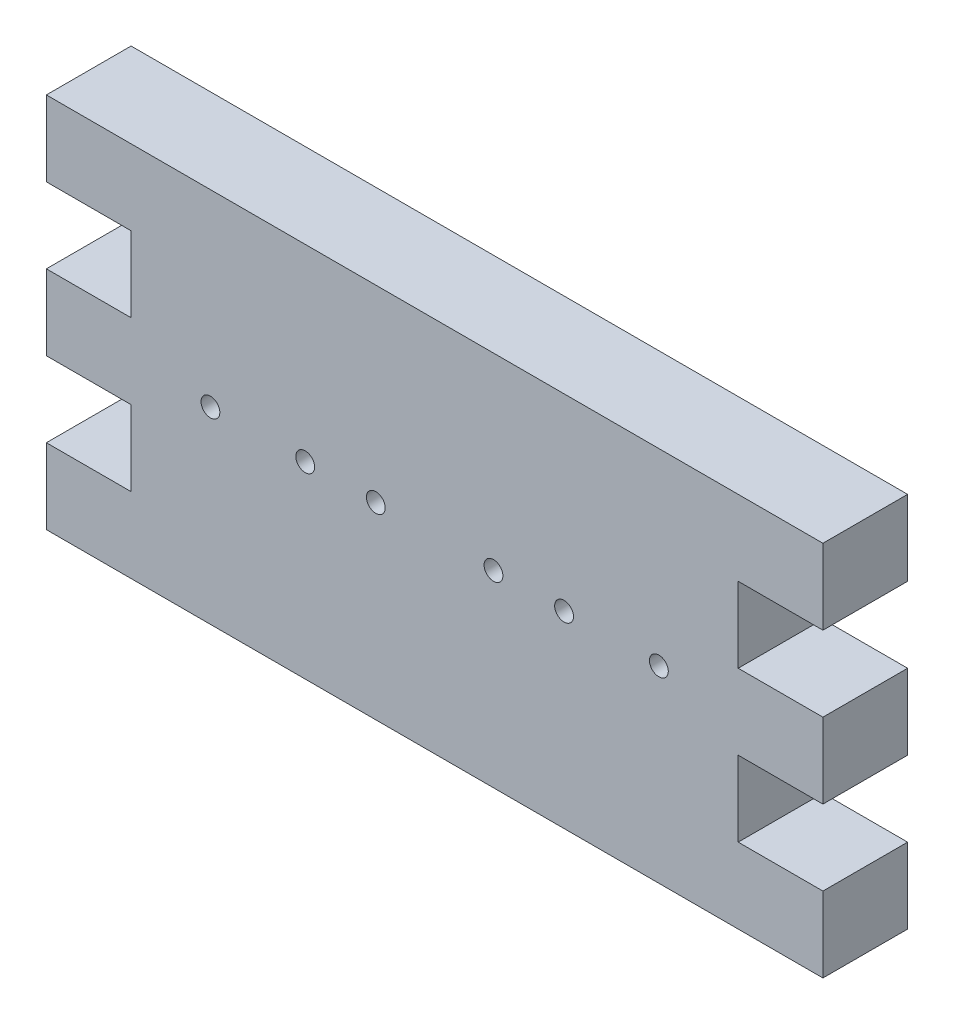
ISO-10303-21;
HEADER;
FILE_DESCRIPTION(('STEP AP214'),'2;1');
FILE_NAME('part.step','',(''),(''),'','','');
FILE_SCHEMA(('AUTOMOTIVE_DESIGN { 1 0 10303 214 1 1 1 1 }'));
ENDSEC;
DATA;
#1=APPLICATION_CONTEXT('core data for automotive mechanical design processes');
#2=APPLICATION_PROTOCOL_DEFINITION('international standard','automotive_design',2000,#1);
#3=PRODUCT_CONTEXT('',#1,'mechanical');
#4=PRODUCT('Part','Part','',(#3));
#5=PRODUCT_RELATED_PRODUCT_CATEGORY('part','',(#4));
#6=PRODUCT_DEFINITION_FORMATION('','',#4);
#7=PRODUCT_DEFINITION_CONTEXT('part definition',#1,'design');
#8=PRODUCT_DEFINITION('design','',#6,#7);
#9=PRODUCT_DEFINITION_SHAPE('','',#8);
#10=(LENGTH_UNIT() NAMED_UNIT(*) SI_UNIT(.MILLI.,.METRE.));
#11=(NAMED_UNIT(*) PLANE_ANGLE_UNIT() SI_UNIT($,.RADIAN.));
#12=(NAMED_UNIT(*) SI_UNIT($,.STERADIAN.) SOLID_ANGLE_UNIT());
#13=UNCERTAINTY_MEASURE_WITH_UNIT(LENGTH_MEASURE(1.E-05),#10,'distance_accuracy_value','');
#14=(GEOMETRIC_REPRESENTATION_CONTEXT(3) GLOBAL_UNCERTAINTY_ASSIGNED_CONTEXT((#13)) GLOBAL_UNIT_ASSIGNED_CONTEXT((#10,
#11,#12)) REPRESENTATION_CONTEXT('',''));
#15=CARTESIAN_POINT('',(0.,0.,0.));
#16=DIRECTION('',(0.,0.,1.));
#17=DIRECTION('',(1.,0.,0.));
#18=AXIS2_PLACEMENT_3D('',#15,#16,#17);
#19=CARTESIAN_POINT('',(0.,0.,18.));
#20=DIRECTION('',(0.,0.,-1.));
#21=DIRECTION('',(-1.,0.,0.));
#22=AXIS2_PLACEMENT_3D('',#19,#20,#21);
#23=PLANE('',#22);
#24=DIRECTION('',(0.,1.,0.));
#25=VECTOR('',#24,1.);
#26=CARTESIAN_POINT('',(122.500000000001,14.0000000000007,18.));
#27=LINE('',#26,#25);
#28=CARTESIAN_POINT('',(122.500000000001,14.0000000000007,18.));
#29=VERTEX_POINT('',#28);
#30=CARTESIAN_POINT('',(122.5,30.,18.));
#31=VERTEX_POINT('',#30);
#32=EDGE_CURVE('E241',#29,#31,#27,.T.);
#33=ORIENTED_EDGE('',*,*,#32,.T.);
#34=DIRECTION('',(-1.,0.,0.));
#35=VECTOR('',#34,1.);
#36=CARTESIAN_POINT('',(-42.5,30.,18.));
#37=LINE('',#36,#35);
#38=CARTESIAN_POINT('',(-42.5,30.,18.));
#39=VERTEX_POINT('',#38);
#40=EDGE_CURVE('E129',#31,#39,#37,.T.);
#41=ORIENTED_EDGE('',*,*,#40,.T.);
#42=DIRECTION('',(0.,-1.,0.));
#43=VECTOR('',#42,1.);
#44=CARTESIAN_POINT('',(-42.5,14.,18.));
#45=LINE('',#44,#43);
#46=CARTESIAN_POINT('',(-42.5,14.,18.));
#47=VERTEX_POINT('',#46);
#48=EDGE_CURVE('E292',#39,#47,#45,.T.);
#49=ORIENTED_EDGE('',*,*,#48,.T.);
#50=DIRECTION('',(1.,0.,0.));
#51=VECTOR('',#50,1.);
#52=CARTESIAN_POINT('',(-42.5,14.,18.));
#53=LINE('',#52,#51);
#54=CARTESIAN_POINT('',(-24.5,14.,18.));
#55=VERTEX_POINT('',#54);
#56=EDGE_CURVE('E311',#47,#55,#53,.T.);
#57=ORIENTED_EDGE('',*,*,#56,.T.);
#58=DIRECTION('',(0.,-1.,0.));
#59=VECTOR('',#58,1.);
#60=CARTESIAN_POINT('',(-24.5,-1.99999999999998,18.));
#61=LINE('',#60,#59);
#62=CARTESIAN_POINT('',(-24.5,-1.99999999999998,18.));
#63=VERTEX_POINT('',#62);
#64=EDGE_CURVE('E308',#55,#63,#61,.T.);
#65=ORIENTED_EDGE('',*,*,#64,.T.);
#66=DIRECTION('',(-1.,0.,0.));
#67=VECTOR('',#66,1.);
#68=CARTESIAN_POINT('',(-42.5,-2.00000000000002,18.));
#69=LINE('',#68,#67);
#70=CARTESIAN_POINT('',(-42.5,-2.00000000000002,18.));
#71=VERTEX_POINT('',#70);
#72=EDGE_CURVE('E310',#63,#71,#69,.T.);
#73=ORIENTED_EDGE('',*,*,#72,.T.);
#74=DIRECTION('',(0.,-1.,0.));
#75=VECTOR('',#74,1.);
#76=CARTESIAN_POINT('',(-42.5,-18.,18.));
#77=LINE('',#76,#75);
#78=CARTESIAN_POINT('',(-42.5,-18.,18.));
#79=VERTEX_POINT('',#78);
#80=EDGE_CURVE('E313',#71,#79,#77,.T.);
#81=ORIENTED_EDGE('',*,*,#80,.T.);
#82=DIRECTION('',(1.,0.,0.));
#83=VECTOR('',#82,1.);
#84=CARTESIAN_POINT('',(-42.5,-18.,18.));
#85=LINE('',#84,#83);
#86=CARTESIAN_POINT('',(-24.5,-18.,18.));
#87=VERTEX_POINT('',#86);
#88=EDGE_CURVE('E319',#79,#87,#85,.T.);
#89=ORIENTED_EDGE('',*,*,#88,.T.);
#90=DIRECTION('',(0.,-1.,0.));
#91=VECTOR('',#90,1.);
#92=CARTESIAN_POINT('',(-24.5,-34.,18.));
#93=LINE('',#92,#91);
#94=CARTESIAN_POINT('',(-24.5,-34.,18.));
#95=VERTEX_POINT('',#94);
#96=EDGE_CURVE('E321',#87,#95,#93,.T.);
#97=ORIENTED_EDGE('',*,*,#96,.T.);
#98=DIRECTION('',(-1.,0.,0.));
#99=VECTOR('',#98,1.);
#100=CARTESIAN_POINT('',(-42.5,-34.,18.));
#101=LINE('',#100,#99);
#102=CARTESIAN_POINT('',(-42.5,-34.,18.));
#103=VERTEX_POINT('',#102);
#104=EDGE_CURVE('E323',#95,#103,#101,.T.);
#105=ORIENTED_EDGE('',*,*,#104,.T.);
#106=DIRECTION('',(0.,-1.,0.));
#107=VECTOR('',#106,1.);
#108=CARTESIAN_POINT('',(-42.5,-50.,18.));
#109=LINE('',#108,#107);
#110=CARTESIAN_POINT('',(-42.5,-50.,18.));
#111=VERTEX_POINT('',#110);
#112=EDGE_CURVE('E325',#103,#111,#109,.T.);
#113=ORIENTED_EDGE('',*,*,#112,.T.);
#114=DIRECTION('',(1.,0.,0.));
#115=VECTOR('',#114,1.);
#116=CARTESIAN_POINT('',(-42.5,-50.,18.));
#117=LINE('',#116,#115);
#118=CARTESIAN_POINT('',(122.5,-50.,18.));
#119=VERTEX_POINT('',#118);
#120=EDGE_CURVE('E327',#111,#119,#117,.T.);
#121=ORIENTED_EDGE('',*,*,#120,.T.);
#122=DIRECTION('',(0.,1.,0.));
#123=VECTOR('',#122,1.);
#124=CARTESIAN_POINT('',(122.5,-50.,18.));
#125=LINE('',#124,#123);
#126=CARTESIAN_POINT('',(122.500000000002,-33.9999999999994,18.));
#127=VERTEX_POINT('',#126);
#128=EDGE_CURVE('E329',#119,#127,#125,.T.);
#129=ORIENTED_EDGE('',*,*,#128,.T.);
#130=DIRECTION('',(-1.,0.,0.));
#131=VECTOR('',#130,1.);
#132=CARTESIAN_POINT('',(122.500000000002,-33.9999999999994,18.));
#133=LINE('',#132,#131);
#134=CARTESIAN_POINT('',(104.500000000002,-33.9999999999996,18.));
#135=VERTEX_POINT('',#134);
#136=EDGE_CURVE('E331',#127,#135,#133,.T.);
#137=ORIENTED_EDGE('',*,*,#136,.T.);
#138=DIRECTION('',(0.,1.,0.));
#139=VECTOR('',#138,1.);
#140=CARTESIAN_POINT('',(104.500000000002,-33.9999999999996,18.));
#141=LINE('',#140,#139);
#142=CARTESIAN_POINT('',(104.500000000002,-17.9999999999996,18.));
#143=VERTEX_POINT('',#142);
#144=EDGE_CURVE('E333',#135,#143,#141,.T.);
#145=ORIENTED_EDGE('',*,*,#144,.T.);
#146=DIRECTION('',(1.,0.,0.));
#147=VECTOR('',#146,1.);
#148=CARTESIAN_POINT('',(122.500000000002,-17.9999999999993,18.));
#149=LINE('',#148,#147);
#150=CARTESIAN_POINT('',(122.500000000002,-17.9999999999993,18.));
#151=VERTEX_POINT('',#150);
#152=EDGE_CURVE('E335',#143,#151,#149,.T.);
#153=ORIENTED_EDGE('',*,*,#152,.T.);
#154=DIRECTION('',(0.,1.,0.));
#155=VECTOR('',#154,1.);
#156=CARTESIAN_POINT('',(122.500000000002,-17.9999999999993,18.));
#157=LINE('',#156,#155);
#158=CARTESIAN_POINT('',(122.500000000001,-1.99999999999935,18.));
#159=VERTEX_POINT('',#158);
#160=EDGE_CURVE('E184',#151,#159,#157,.T.);
#161=ORIENTED_EDGE('',*,*,#160,.T.);
#162=DIRECTION('',(-1.,0.,0.));
#163=VECTOR('',#162,1.);
#164=CARTESIAN_POINT('',(122.500000000001,-1.99999999999935,18.));
#165=LINE('',#164,#163);
#166=CARTESIAN_POINT('',(104.500000000001,-1.99999999999954,18.));
#167=VERTEX_POINT('',#166);
#168=EDGE_CURVE('E178',#159,#167,#165,.T.);
#169=ORIENTED_EDGE('',*,*,#168,.T.);
#170=DIRECTION('',(0.,1.,0.));
#171=VECTOR('',#170,1.);
#172=CARTESIAN_POINT('',(104.500000000001,-1.99999999999954,18.));
#173=LINE('',#172,#171);
#174=CARTESIAN_POINT('',(104.500000000001,14.0000000000005,18.));
#175=VERTEX_POINT('',#174);
#176=EDGE_CURVE('E182',#167,#175,#173,.T.);
#177=ORIENTED_EDGE('',*,*,#176,.T.);
#178=DIRECTION('',(1.,0.,0.));
#179=VECTOR('',#178,1.);
#180=CARTESIAN_POINT('',(122.500000000001,14.0000000000007,18.));
#181=LINE('',#180,#179);
#182=EDGE_CURVE('E50',#175,#29,#181,.T.);
#183=ORIENTED_EDGE('',*,*,#182,.T.);
#184=EDGE_LOOP('',(#33,#41,#49,#57,#65,#73,#81,#89,#97,#105,#113,#121,#129,#137,#145,#153,#161,
#169,#177,#183));
#185=FACE_BOUND('',#184,.T.);
#186=CARTESIAN_POINT('',(12.5,-10.,18.));
#187=DIRECTION('',(0.,0.,1.));
#188=DIRECTION('',(1.,0.,0.));
#189=AXIS2_PLACEMENT_3D('',#186,#187,#188);
#190=CIRCLE('',#189,2.);
#191=CARTESIAN_POINT('',(14.5,-10.,18.));
#192=VERTEX_POINT('',#191);
#193=EDGE_CURVE('E206',#192,#192,#190,.T.);
#194=ORIENTED_EDGE('',*,*,#193,.F.);
#195=EDGE_LOOP('',(#194));
#196=FACE_BOUND('',#195,.T.);
#197=CARTESIAN_POINT('',(-7.64571959777527,-10.,18.));
#198=DIRECTION('',(0.,0.,1.));
#199=DIRECTION('',(1.,0.,0.));
#200=AXIS2_PLACEMENT_3D('',#197,#198,#199);
#201=CIRCLE('',#200,2.);
#202=CARTESIAN_POINT('',(-5.64571959777527,-10.,18.));
#203=VERTEX_POINT('',#202);
#204=EDGE_CURVE('E419',#203,#203,#201,.T.);
#205=ORIENTED_EDGE('',*,*,#204,.F.);
#206=EDGE_LOOP('',(#205));
#207=FACE_BOUND('',#206,.T.);
#208=CARTESIAN_POINT('',(27.5000000000001,-9.99999999999992,18.));
#209=DIRECTION('',(0.,0.,1.));
#210=DIRECTION('',(1.,0.,0.));
#211=AXIS2_PLACEMENT_3D('',#208,#209,#210);
#212=CIRCLE('',#211,2.);
#213=CARTESIAN_POINT('',(29.5000000000001,-9.99999999999992,18.));
#214=VERTEX_POINT('',#213);
#215=EDGE_CURVE('E413',#214,#214,#212,.T.);
#216=ORIENTED_EDGE('',*,*,#215,.F.);
#217=EDGE_LOOP('',(#216));
#218=FACE_BOUND('',#217,.T.);
#219=CARTESIAN_POINT('',(52.5000000000014,-9.99999999999992,18.));
#220=DIRECTION('',(0.,0.,1.));
#221=DIRECTION('',(-1.,0.,0.));
#222=AXIS2_PLACEMENT_3D('',#219,#220,#221);
#223=CIRCLE('',#222,2.00000000000001);
#224=CARTESIAN_POINT('',(50.5000000000014,-9.99999999999992,18.));
#225=VERTEX_POINT('',#224);
#226=EDGE_CURVE('E407',#225,#225,#223,.T.);
#227=ORIENTED_EDGE('',*,*,#226,.F.);
#228=EDGE_LOOP('',(#227));
#229=FACE_BOUND('',#228,.T.);
#230=CARTESIAN_POINT('',(67.5000000000015,-9.99999999999978,18.));
#231=DIRECTION('',(0.,0.,1.));
#232=DIRECTION('',(-1.,0.,0.));
#233=AXIS2_PLACEMENT_3D('',#230,#231,#232);
#234=CIRCLE('',#233,2.00000000000001);
#235=CARTESIAN_POINT('',(65.5000000000015,-9.99999999999978,18.));
#236=VERTEX_POINT('',#235);
#237=EDGE_CURVE('E401',#236,#236,#234,.T.);
#238=ORIENTED_EDGE('',*,*,#237,.F.);
#239=EDGE_LOOP('',(#238));
#240=FACE_BOUND('',#239,.T.);
#241=CARTESIAN_POINT('',(87.6457195977753,-10.,18.));
#242=DIRECTION('',(0.,0.,1.));
#243=DIRECTION('',(-1.,0.,0.));
#244=AXIS2_PLACEMENT_3D('',#241,#242,#243);
#245=CIRCLE('',#244,2.00000000000001);
#246=CARTESIAN_POINT('',(85.6457195977753,-10.,18.));
#247=VERTEX_POINT('',#246);
#248=EDGE_CURVE('E392',#247,#247,#245,.T.);
#249=ORIENTED_EDGE('',*,*,#248,.F.);
#250=EDGE_LOOP('',(#249));
#251=FACE_BOUND('',#250,.T.);
#252=ADVANCED_FACE('F33',(#185,#196,#207,#218,#229,#240,#251),#23,.F.);
#253=CARTESIAN_POINT('',(0.,0.,0.));
#254=DIRECTION('',(0.,0.,-1.));
#255=DIRECTION('',(-1.,0.,0.));
#256=AXIS2_PLACEMENT_3D('',#253,#254,#255);
#257=PLANE('',#256);
#258=CARTESIAN_POINT('',(67.5000000000015,-9.99999999999978,0.));
#259=DIRECTION('',(0.,0.,1.));
#260=DIRECTION('',(-1.,0.,0.));
#261=AXIS2_PLACEMENT_3D('',#258,#259,#260);
#262=CIRCLE('',#261,2.00000000000001);
#263=CARTESIAN_POINT('',(65.5000000000015,-9.99999999999978,0.));
#264=VERTEX_POINT('',#263);
#265=EDGE_CURVE('E398',#264,#264,#262,.T.);
#266=ORIENTED_EDGE('',*,*,#265,.T.);
#267=EDGE_LOOP('',(#266));
#268=FACE_BOUND('',#267,.T.);
#269=CARTESIAN_POINT('',(27.5000000000001,-9.99999999999992,0.));
#270=DIRECTION('',(0.,0.,1.));
#271=DIRECTION('',(1.,0.,0.));
#272=AXIS2_PLACEMENT_3D('',#269,#270,#271);
#273=CIRCLE('',#272,2.);
#274=CARTESIAN_POINT('',(29.5000000000001,-9.99999999999992,0.));
#275=VERTEX_POINT('',#274);
#276=EDGE_CURVE('E410',#275,#275,#273,.T.);
#277=ORIENTED_EDGE('',*,*,#276,.T.);
#278=EDGE_LOOP('',(#277));
#279=FACE_BOUND('',#278,.T.);
#280=CARTESIAN_POINT('',(12.5,-10.,0.));
#281=DIRECTION('',(0.,0.,1.));
#282=DIRECTION('',(1.,0.,0.));
#283=AXIS2_PLACEMENT_3D('',#280,#281,#282);
#284=CIRCLE('',#283,2.);
#285=CARTESIAN_POINT('',(14.5,-10.,0.));
#286=VERTEX_POINT('',#285);
#287=EDGE_CURVE('E422',#286,#286,#284,.T.);
#288=ORIENTED_EDGE('',*,*,#287,.T.);
#289=EDGE_LOOP('',(#288));
#290=FACE_BOUND('',#289,.T.);
#291=DIRECTION('',(0.,1.,0.));
#292=VECTOR('',#291,1.);
#293=CARTESIAN_POINT('',(122.500000000001,14.0000000000007,0.));
#294=LINE('',#293,#292);
#295=CARTESIAN_POINT('',(122.500000000001,14.0000000000007,0.));
#296=VERTEX_POINT('',#295);
#297=CARTESIAN_POINT('',(122.5,30.,0.));
#298=VERTEX_POINT('',#297);
#299=EDGE_CURVE('E202',#296,#298,#294,.T.);
#300=ORIENTED_EDGE('',*,*,#299,.F.);
#301=DIRECTION('',(1.,0.,0.));
#302=VECTOR('',#301,1.);
#303=CARTESIAN_POINT('',(122.500000000001,14.0000000000007,0.));
#304=LINE('',#303,#302);
#305=CARTESIAN_POINT('',(104.500000000001,14.0000000000005,0.));
#306=VERTEX_POINT('',#305);
#307=EDGE_CURVE('E121',#306,#296,#304,.T.);
#308=ORIENTED_EDGE('',*,*,#307,.F.);
#309=DIRECTION('',(0.,1.,0.));
#310=VECTOR('',#309,1.);
#311=CARTESIAN_POINT('',(104.500000000001,-1.99999999999954,0.));
#312=LINE('',#311,#310);
#313=CARTESIAN_POINT('',(104.500000000001,-1.99999999999954,0.));
#314=VERTEX_POINT('',#313);
#315=EDGE_CURVE('E115',#314,#306,#312,.T.);
#316=ORIENTED_EDGE('',*,*,#315,.F.);
#317=DIRECTION('',(-1.,0.,0.));
#318=VECTOR('',#317,1.);
#319=CARTESIAN_POINT('',(122.500000000001,-1.99999999999935,0.));
#320=LINE('',#319,#318);
#321=CARTESIAN_POINT('',(122.500000000001,-1.99999999999935,0.));
#322=VERTEX_POINT('',#321);
#323=EDGE_CURVE('E192',#322,#314,#320,.T.);
#324=ORIENTED_EDGE('',*,*,#323,.F.);
#325=DIRECTION('',(0.,1.,0.));
#326=VECTOR('',#325,1.);
#327=CARTESIAN_POINT('',(122.500000000002,-17.9999999999993,0.));
#328=LINE('',#327,#326);
#329=CARTESIAN_POINT('',(122.500000000002,-17.9999999999993,0.));
#330=VERTEX_POINT('',#329);
#331=EDGE_CURVE('E236',#330,#322,#328,.T.);
#332=ORIENTED_EDGE('',*,*,#331,.F.);
#333=DIRECTION('',(1.,0.,0.));
#334=VECTOR('',#333,1.);
#335=CARTESIAN_POINT('',(122.500000000002,-17.9999999999993,0.));
#336=LINE('',#335,#334);
#337=CARTESIAN_POINT('',(104.500000000002,-17.9999999999996,0.));
#338=VERTEX_POINT('',#337);
#339=EDGE_CURVE('E234',#338,#330,#336,.T.);
#340=ORIENTED_EDGE('',*,*,#339,.F.);
#341=DIRECTION('',(0.,1.,0.));
#342=VECTOR('',#341,1.);
#343=CARTESIAN_POINT('',(104.500000000002,-33.9999999999996,0.));
#344=LINE('',#343,#342);
#345=CARTESIAN_POINT('',(104.500000000002,-33.9999999999996,0.));
#346=VERTEX_POINT('',#345);
#347=EDGE_CURVE('E232',#346,#338,#344,.T.);
#348=ORIENTED_EDGE('',*,*,#347,.F.);
#349=DIRECTION('',(-1.,0.,0.));
#350=VECTOR('',#349,1.);
#351=CARTESIAN_POINT('',(122.500000000002,-33.9999999999994,0.));
#352=LINE('',#351,#350);
#353=CARTESIAN_POINT('',(122.500000000002,-33.9999999999994,0.));
#354=VERTEX_POINT('',#353);
#355=EDGE_CURVE('E230',#354,#346,#352,.T.);
#356=ORIENTED_EDGE('',*,*,#355,.F.);
#357=DIRECTION('',(0.,1.,0.));
#358=VECTOR('',#357,1.);
#359=CARTESIAN_POINT('',(122.5,-50.,0.));
#360=LINE('',#359,#358);
#361=CARTESIAN_POINT('',(122.5,-50.,0.));
#362=VERTEX_POINT('',#361);
#363=EDGE_CURVE('E228',#362,#354,#360,.T.);
#364=ORIENTED_EDGE('',*,*,#363,.F.);
#365=DIRECTION('',(1.,0.,0.));
#366=VECTOR('',#365,1.);
#367=CARTESIAN_POINT('',(-42.5,-50.,0.));
#368=LINE('',#367,#366);
#369=CARTESIAN_POINT('',(-42.5,-50.,0.));
#370=VERTEX_POINT('',#369);
#371=EDGE_CURVE('E226',#370,#362,#368,.T.);
#372=ORIENTED_EDGE('',*,*,#371,.F.);
#373=DIRECTION('',(0.,-1.,0.));
#374=VECTOR('',#373,1.);
#375=CARTESIAN_POINT('',(-42.5,-50.,0.));
#376=LINE('',#375,#374);
#377=CARTESIAN_POINT('',(-42.5,-34.,0.));
#378=VERTEX_POINT('',#377);
#379=EDGE_CURVE('E224',#378,#370,#376,.T.);
#380=ORIENTED_EDGE('',*,*,#379,.F.);
#381=DIRECTION('',(-1.,0.,0.));
#382=VECTOR('',#381,1.);
#383=CARTESIAN_POINT('',(-42.5,-34.,0.));
#384=LINE('',#383,#382);
#385=CARTESIAN_POINT('',(-24.5,-34.,0.));
#386=VERTEX_POINT('',#385);
#387=EDGE_CURVE('E222',#386,#378,#384,.T.);
#388=ORIENTED_EDGE('',*,*,#387,.F.);
#389=DIRECTION('',(0.,-1.,0.));
#390=VECTOR('',#389,1.);
#391=CARTESIAN_POINT('',(-24.5,-34.,0.));
#392=LINE('',#391,#390);
#393=CARTESIAN_POINT('',(-24.5,-18.,0.));
#394=VERTEX_POINT('',#393);
#395=EDGE_CURVE('E220',#394,#386,#392,.T.);
#396=ORIENTED_EDGE('',*,*,#395,.F.);
#397=DIRECTION('',(1.,0.,0.));
#398=VECTOR('',#397,1.);
#399=CARTESIAN_POINT('',(-42.5,-18.,0.));
#400=LINE('',#399,#398);
#401=CARTESIAN_POINT('',(-42.5,-18.,0.));
#402=VERTEX_POINT('',#401);
#403=EDGE_CURVE('E218',#402,#394,#400,.T.);
#404=ORIENTED_EDGE('',*,*,#403,.F.);
#405=DIRECTION('',(0.,-1.,0.));
#406=VECTOR('',#405,1.);
#407=CARTESIAN_POINT('',(-42.5,-18.,0.));
#408=LINE('',#407,#406);
#409=CARTESIAN_POINT('',(-42.5,-2.00000000000002,0.));
#410=VERTEX_POINT('',#409);
#411=EDGE_CURVE('E216',#410,#402,#408,.T.);
#412=ORIENTED_EDGE('',*,*,#411,.F.);
#413=DIRECTION('',(-1.,0.,0.));
#414=VECTOR('',#413,1.);
#415=CARTESIAN_POINT('',(-42.5,-2.00000000000002,0.));
#416=LINE('',#415,#414);
#417=CARTESIAN_POINT('',(-24.5,-1.99999999999998,0.));
#418=VERTEX_POINT('',#417);
#419=EDGE_CURVE('E214',#418,#410,#416,.T.);
#420=ORIENTED_EDGE('',*,*,#419,.F.);
#421=DIRECTION('',(0.,-1.,0.));
#422=VECTOR('',#421,1.);
#423=CARTESIAN_POINT('',(-24.5,-1.99999999999998,0.));
#424=LINE('',#423,#422);
#425=CARTESIAN_POINT('',(-24.5,14.,0.));
#426=VERTEX_POINT('',#425);
#427=EDGE_CURVE('E212',#426,#418,#424,.T.);
#428=ORIENTED_EDGE('',*,*,#427,.F.);
#429=DIRECTION('',(1.,0.,0.));
#430=VECTOR('',#429,1.);
#431=CARTESIAN_POINT('',(-42.5,14.,0.));
#432=LINE('',#431,#430);
#433=CARTESIAN_POINT('',(-42.5,14.,0.));
#434=VERTEX_POINT('',#433);
#435=EDGE_CURVE('E210',#434,#426,#432,.T.);
#436=ORIENTED_EDGE('',*,*,#435,.F.);
#437=DIRECTION('',(0.,-1.,0.));
#438=VECTOR('',#437,1.);
#439=CARTESIAN_POINT('',(-42.5,14.,0.));
#440=LINE('',#439,#438);
#441=CARTESIAN_POINT('',(-42.5,30.,0.));
#442=VERTEX_POINT('',#441);
#443=EDGE_CURVE('E208',#442,#434,#440,.T.);
#444=ORIENTED_EDGE('',*,*,#443,.F.);
#445=DIRECTION('',(-1.,0.,0.));
#446=VECTOR('',#445,1.);
#447=CARTESIAN_POINT('',(-42.5,30.,0.));
#448=LINE('',#447,#446);
#449=EDGE_CURVE('E205',#298,#442,#448,.T.);
#450=ORIENTED_EDGE('',*,*,#449,.F.);
#451=EDGE_LOOP('',(#300,#308,#316,#324,#332,#340,#348,#356,#364,#372,#380,#388,#396,#404,#412,
#420,#428,#436,#444,#450));
#452=FACE_BOUND('',#451,.T.);
#453=CARTESIAN_POINT('',(-7.64571959777527,-10.,0.));
#454=DIRECTION('',(0.,0.,1.));
#455=DIRECTION('',(1.,0.,0.));
#456=AXIS2_PLACEMENT_3D('',#453,#454,#455);
#457=CIRCLE('',#456,2.);
#458=CARTESIAN_POINT('',(-5.64571959777527,-10.,0.));
#459=VERTEX_POINT('',#458);
#460=EDGE_CURVE('E416',#459,#459,#457,.T.);
#461=ORIENTED_EDGE('',*,*,#460,.T.);
#462=EDGE_LOOP('',(#461));
#463=FACE_BOUND('',#462,.T.);
#464=CARTESIAN_POINT('',(52.5000000000014,-9.99999999999992,0.));
#465=DIRECTION('',(0.,0.,1.));
#466=DIRECTION('',(-1.,0.,0.));
#467=AXIS2_PLACEMENT_3D('',#464,#465,#466);
#468=CIRCLE('',#467,2.00000000000001);
#469=CARTESIAN_POINT('',(50.5000000000014,-9.99999999999992,0.));
#470=VERTEX_POINT('',#469);
#471=EDGE_CURVE('E404',#470,#470,#468,.T.);
#472=ORIENTED_EDGE('',*,*,#471,.T.);
#473=EDGE_LOOP('',(#472));
#474=FACE_BOUND('',#473,.T.);
#475=CARTESIAN_POINT('',(87.6457195977753,-10.,0.));
#476=DIRECTION('',(0.,0.,1.));
#477=DIRECTION('',(-1.,0.,0.));
#478=AXIS2_PLACEMENT_3D('',#475,#476,#477);
#479=CIRCLE('',#478,2.00000000000001);
#480=CARTESIAN_POINT('',(85.6457195977753,-10.,0.));
#481=VERTEX_POINT('',#480);
#482=EDGE_CURVE('E395',#481,#481,#479,.T.);
#483=ORIENTED_EDGE('',*,*,#482,.T.);
#484=EDGE_LOOP('',(#483));
#485=FACE_BOUND('',#484,.T.);
#486=ADVANCED_FACE('F296',(#268,#279,#290,#452,#463,#474,#485),#257,.T.);
#487=CARTESIAN_POINT('',(122.500000000001,14.0000000000007,18.));
#488=DIRECTION('',(-1.,0.,0.));
#489=DIRECTION('',(0.,-1.,0.));
#490=AXIS2_PLACEMENT_3D('',#487,#488,#489);
#491=PLANE('',#490);
#492=ORIENTED_EDGE('',*,*,#299,.T.);
#493=DIRECTION('',(0.,0.,-1.));
#494=VECTOR('',#493,1.);
#495=CARTESIAN_POINT('',(122.5,30.,18.));
#496=LINE('',#495,#494);
#497=EDGE_CURVE('E11',#31,#298,#496,.T.);
#498=ORIENTED_EDGE('',*,*,#497,.F.);
#499=ORIENTED_EDGE('',*,*,#32,.F.);
#500=DIRECTION('',(0.,0.,-1.));
#501=VECTOR('',#500,1.);
#502=CARTESIAN_POINT('',(122.500000000001,14.0000000000007,18.));
#503=LINE('',#502,#501);
#504=EDGE_CURVE('E198',#29,#296,#503,.T.);
#505=ORIENTED_EDGE('',*,*,#504,.T.);
#506=EDGE_LOOP('',(#492,#498,#499,#505));
#507=FACE_BOUND('',#506,.T.);
#508=ADVANCED_FACE('F35',(#507),#491,.F.);
#509=CARTESIAN_POINT('',(-42.5,30.,18.));
#510=DIRECTION('',(0.,-1.,0.));
#511=DIRECTION('',(0.,0.,-1.));
#512=AXIS2_PLACEMENT_3D('',#509,#510,#511);
#513=PLANE('',#512);
#514=ORIENTED_EDGE('',*,*,#449,.T.);
#515=DIRECTION('',(0.,0.,-1.));
#516=VECTOR('',#515,1.);
#517=CARTESIAN_POINT('',(-42.5,30.,18.));
#518=LINE('',#517,#516);
#519=EDGE_CURVE('E42',#39,#442,#518,.T.);
#520=ORIENTED_EDGE('',*,*,#519,.F.);
#521=ORIENTED_EDGE('',*,*,#40,.F.);
#522=ORIENTED_EDGE('',*,*,#497,.T.);
#523=EDGE_LOOP('',(#514,#520,#521,#522));
#524=FACE_BOUND('',#523,.T.);
#525=ADVANCED_FACE('F632',(#524),#513,.F.);
#526=CARTESIAN_POINT('',(-42.5,14.,18.));
#527=DIRECTION('',(1.,0.,0.));
#528=DIRECTION('',(0.,0.,-1.));
#529=AXIS2_PLACEMENT_3D('',#526,#527,#528);
#530=PLANE('',#529);
#531=ORIENTED_EDGE('',*,*,#443,.T.);
#532=DIRECTION('',(0.,0.,-1.));
#533=VECTOR('',#532,1.);
#534=CARTESIAN_POINT('',(-42.5,14.,18.));
#535=LINE('',#534,#533);
#536=EDGE_CURVE('E284',#47,#434,#535,.T.);
#537=ORIENTED_EDGE('',*,*,#536,.F.);
#538=ORIENTED_EDGE('',*,*,#48,.F.);
#539=ORIENTED_EDGE('',*,*,#519,.T.);
#540=EDGE_LOOP('',(#531,#537,#538,#539));
#541=FACE_BOUND('',#540,.T.);
#542=ADVANCED_FACE('F290',(#541),#530,.F.);
#543=CARTESIAN_POINT('',(-42.5,14.,18.));
#544=DIRECTION('',(0.,1.,0.));
#545=DIRECTION('',(0.,0.,1.));
#546=AXIS2_PLACEMENT_3D('',#543,#544,#545);
#547=PLANE('',#546);
#548=ORIENTED_EDGE('',*,*,#435,.T.);
#549=DIRECTION('',(0.,0.,-1.));
#550=VECTOR('',#549,1.);
#551=CARTESIAN_POINT('',(-24.5,14.,18.));
#552=LINE('',#551,#550);
#553=EDGE_CURVE('E281',#55,#426,#552,.T.);
#554=ORIENTED_EDGE('',*,*,#553,.F.);
#555=ORIENTED_EDGE('',*,*,#56,.F.);
#556=ORIENTED_EDGE('',*,*,#536,.T.);
#557=EDGE_LOOP('',(#548,#554,#555,#556));
#558=FACE_BOUND('',#557,.T.);
#559=ADVANCED_FACE('F302',(#558),#547,.F.);
#560=CARTESIAN_POINT('',(-24.5,-1.99999999999998,18.));
#561=DIRECTION('',(1.,0.,0.));
#562=DIRECTION('',(0.,0.,-1.));
#563=AXIS2_PLACEMENT_3D('',#560,#561,#562);
#564=PLANE('',#563);
#565=ORIENTED_EDGE('',*,*,#427,.T.);
#566=DIRECTION('',(0.,0.,-1.));
#567=VECTOR('',#566,1.);
#568=CARTESIAN_POINT('',(-24.5,-1.99999999999998,18.));
#569=LINE('',#568,#567);
#570=EDGE_CURVE('E278',#63,#418,#569,.T.);
#571=ORIENTED_EDGE('',*,*,#570,.F.);
#572=ORIENTED_EDGE('',*,*,#64,.F.);
#573=ORIENTED_EDGE('',*,*,#553,.T.);
#574=EDGE_LOOP('',(#565,#571,#572,#573));
#575=FACE_BOUND('',#574,.T.);
#576=ADVANCED_FACE('F306',(#575),#564,.F.);
#577=CARTESIAN_POINT('',(-42.5,-2.00000000000002,18.));
#578=DIRECTION('',(0.,-1.,0.));
#579=DIRECTION('',(1.,0.,0.));
#580=AXIS2_PLACEMENT_3D('',#577,#578,#579);
#581=PLANE('',#580);
#582=ORIENTED_EDGE('',*,*,#419,.T.);
#583=DIRECTION('',(0.,0.,-1.));
#584=VECTOR('',#583,1.);
#585=CARTESIAN_POINT('',(-42.5,-2.00000000000002,18.));
#586=LINE('',#585,#584);
#587=EDGE_CURVE('E275',#71,#410,#586,.T.);
#588=ORIENTED_EDGE('',*,*,#587,.F.);
#589=ORIENTED_EDGE('',*,*,#72,.F.);
#590=ORIENTED_EDGE('',*,*,#570,.T.);
#591=EDGE_LOOP('',(#582,#588,#589,#590));
#592=FACE_BOUND('',#591,.T.);
#593=ADVANCED_FACE('F597',(#592),#581,.F.);
#594=CARTESIAN_POINT('',(-42.5,-18.,18.));
#595=DIRECTION('',(1.,0.,0.));
#596=DIRECTION('',(0.,0.,-1.));
#597=AXIS2_PLACEMENT_3D('',#594,#595,#596);
#598=PLANE('',#597);
#599=ORIENTED_EDGE('',*,*,#411,.T.);
#600=DIRECTION('',(0.,0.,-1.));
#601=VECTOR('',#600,1.);
#602=CARTESIAN_POINT('',(-42.5,-18.,18.));
#603=LINE('',#602,#601);
#604=EDGE_CURVE('E272',#79,#402,#603,.T.);
#605=ORIENTED_EDGE('',*,*,#604,.F.);
#606=ORIENTED_EDGE('',*,*,#80,.F.);
#607=ORIENTED_EDGE('',*,*,#587,.T.);
#608=EDGE_LOOP('',(#599,#605,#606,#607));
#609=FACE_BOUND('',#608,.T.);
#610=ADVANCED_FACE('F587',(#609),#598,.F.);
#611=CARTESIAN_POINT('',(-42.5,-18.,18.));
#612=DIRECTION('',(0.,1.,0.));
#613=DIRECTION('',(0.,0.,1.));
#614=AXIS2_PLACEMENT_3D('',#611,#612,#613);
#615=PLANE('',#614);
#616=ORIENTED_EDGE('',*,*,#403,.T.);
#617=DIRECTION('',(0.,0.,-1.));
#618=VECTOR('',#617,1.);
#619=CARTESIAN_POINT('',(-24.5,-18.,18.));
#620=LINE('',#619,#618);
#621=EDGE_CURVE('E269',#87,#394,#620,.T.);
#622=ORIENTED_EDGE('',*,*,#621,.F.);
#623=ORIENTED_EDGE('',*,*,#88,.F.);
#624=ORIENTED_EDGE('',*,*,#604,.T.);
#625=EDGE_LOOP('',(#616,#622,#623,#624));
#626=FACE_BOUND('',#625,.T.);
#627=ADVANCED_FACE('F577',(#626),#615,.F.);
#628=CARTESIAN_POINT('',(-24.5,-34.,18.));
#629=DIRECTION('',(1.,0.,0.));
#630=DIRECTION('',(0.,0.,-1.));
#631=AXIS2_PLACEMENT_3D('',#628,#629,#630);
#632=PLANE('',#631);
#633=ORIENTED_EDGE('',*,*,#395,.T.);
#634=DIRECTION('',(0.,0.,-1.));
#635=VECTOR('',#634,1.);
#636=CARTESIAN_POINT('',(-24.5,-34.,18.));
#637=LINE('',#636,#635);
#638=EDGE_CURVE('E266',#95,#386,#637,.T.);
#639=ORIENTED_EDGE('',*,*,#638,.F.);
#640=ORIENTED_EDGE('',*,*,#96,.F.);
#641=ORIENTED_EDGE('',*,*,#621,.T.);
#642=EDGE_LOOP('',(#633,#639,#640,#641));
#643=FACE_BOUND('',#642,.T.);
#644=ADVANCED_FACE('F567',(#643),#632,.F.);
#645=CARTESIAN_POINT('',(-42.5,-34.,18.));
#646=DIRECTION('',(0.,-1.,0.));
#647=DIRECTION('',(0.,0.,-1.));
#648=AXIS2_PLACEMENT_3D('',#645,#646,#647);
#649=PLANE('',#648);
#650=ORIENTED_EDGE('',*,*,#387,.T.);
#651=DIRECTION('',(0.,0.,-1.));
#652=VECTOR('',#651,1.);
#653=CARTESIAN_POINT('',(-42.5,-34.,18.));
#654=LINE('',#653,#652);
#655=EDGE_CURVE('E263',#103,#378,#654,.T.);
#656=ORIENTED_EDGE('',*,*,#655,.F.);
#657=ORIENTED_EDGE('',*,*,#104,.F.);
#658=ORIENTED_EDGE('',*,*,#638,.T.);
#659=EDGE_LOOP('',(#650,#656,#657,#658));
#660=FACE_BOUND('',#659,.T.);
#661=ADVANCED_FACE('F557',(#660),#649,.F.);
#662=CARTESIAN_POINT('',(-42.5,-50.,18.));
#663=DIRECTION('',(1.,0.,0.));
#664=DIRECTION('',(0.,0.,-1.));
#665=AXIS2_PLACEMENT_3D('',#662,#663,#664);
#666=PLANE('',#665);
#667=ORIENTED_EDGE('',*,*,#379,.T.);
#668=DIRECTION('',(0.,0.,-1.));
#669=VECTOR('',#668,1.);
#670=CARTESIAN_POINT('',(-42.5,-50.,18.));
#671=LINE('',#670,#669);
#672=EDGE_CURVE('E260',#111,#370,#671,.T.);
#673=ORIENTED_EDGE('',*,*,#672,.F.);
#674=ORIENTED_EDGE('',*,*,#112,.F.);
#675=ORIENTED_EDGE('',*,*,#655,.T.);
#676=EDGE_LOOP('',(#667,#673,#674,#675));
#677=FACE_BOUND('',#676,.T.);
#678=ADVANCED_FACE('F547',(#677),#666,.F.);
#679=CARTESIAN_POINT('',(-42.5,-50.,18.));
#680=DIRECTION('',(0.,1.,0.));
#681=DIRECTION('',(0.,0.,1.));
#682=AXIS2_PLACEMENT_3D('',#679,#680,#681);
#683=PLANE('',#682);
#684=ORIENTED_EDGE('',*,*,#371,.T.);
#685=DIRECTION('',(0.,0.,-1.));
#686=VECTOR('',#685,1.);
#687=CARTESIAN_POINT('',(122.5,-50.,18.));
#688=LINE('',#687,#686);
#689=EDGE_CURVE('E257',#119,#362,#688,.T.);
#690=ORIENTED_EDGE('',*,*,#689,.F.);
#691=ORIENTED_EDGE('',*,*,#120,.F.);
#692=ORIENTED_EDGE('',*,*,#672,.T.);
#693=EDGE_LOOP('',(#684,#690,#691,#692));
#694=FACE_BOUND('',#693,.T.);
#695=ADVANCED_FACE('F537',(#694),#683,.F.);
#696=CARTESIAN_POINT('',(122.5,-50.,18.));
#697=DIRECTION('',(-1.,0.,0.));
#698=DIRECTION('',(0.,-1.,0.));
#699=AXIS2_PLACEMENT_3D('',#696,#697,#698);
#700=PLANE('',#699);
#701=ORIENTED_EDGE('',*,*,#363,.T.);
#702=DIRECTION('',(0.,0.,-1.));
#703=VECTOR('',#702,1.);
#704=CARTESIAN_POINT('',(122.500000000002,-33.9999999999994,18.));
#705=LINE('',#704,#703);
#706=EDGE_CURVE('E254',#127,#354,#705,.T.);
#707=ORIENTED_EDGE('',*,*,#706,.F.);
#708=ORIENTED_EDGE('',*,*,#128,.F.);
#709=ORIENTED_EDGE('',*,*,#689,.T.);
#710=EDGE_LOOP('',(#701,#707,#708,#709));
#711=FACE_BOUND('',#710,.T.);
#712=ADVANCED_FACE('F527',(#711),#700,.F.);
#713=CARTESIAN_POINT('',(122.500000000002,-33.9999999999994,18.));
#714=DIRECTION('',(0.,-1.,0.));
#715=DIRECTION('',(1.,0.,0.));
#716=AXIS2_PLACEMENT_3D('',#713,#714,#715);
#717=PLANE('',#716);
#718=ORIENTED_EDGE('',*,*,#355,.T.);
#719=DIRECTION('',(0.,0.,-1.));
#720=VECTOR('',#719,1.);
#721=CARTESIAN_POINT('',(104.500000000002,-33.9999999999996,18.));
#722=LINE('',#721,#720);
#723=EDGE_CURVE('E251',#135,#346,#722,.T.);
#724=ORIENTED_EDGE('',*,*,#723,.F.);
#725=ORIENTED_EDGE('',*,*,#136,.F.);
#726=ORIENTED_EDGE('',*,*,#706,.T.);
#727=EDGE_LOOP('',(#718,#724,#725,#726));
#728=FACE_BOUND('',#727,.T.);
#729=ADVANCED_FACE('F517',(#728),#717,.F.);
#730=CARTESIAN_POINT('',(104.500000000002,-33.9999999999996,18.));
#731=DIRECTION('',(-1.,0.,0.));
#732=DIRECTION('',(0.,-1.,0.));
#733=AXIS2_PLACEMENT_3D('',#730,#731,#732);
#734=PLANE('',#733);
#735=ORIENTED_EDGE('',*,*,#347,.T.);
#736=DIRECTION('',(0.,0.,-1.));
#737=VECTOR('',#736,1.);
#738=CARTESIAN_POINT('',(104.500000000002,-17.9999999999996,18.));
#739=LINE('',#738,#737);
#740=EDGE_CURVE('E248',#143,#338,#739,.T.);
#741=ORIENTED_EDGE('',*,*,#740,.F.);
#742=ORIENTED_EDGE('',*,*,#144,.F.);
#743=ORIENTED_EDGE('',*,*,#723,.T.);
#744=EDGE_LOOP('',(#735,#741,#742,#743));
#745=FACE_BOUND('',#744,.T.);
#746=ADVANCED_FACE('F508',(#745),#734,.F.);
#747=CARTESIAN_POINT('',(122.500000000002,-17.9999999999993,18.));
#748=DIRECTION('',(0.,1.,0.));
#749=DIRECTION('',(-1.,0.,0.));
#750=AXIS2_PLACEMENT_3D('',#747,#748,#749);
#751=PLANE('',#750);
#752=ORIENTED_EDGE('',*,*,#339,.T.);
#753=DIRECTION('',(0.,0.,-1.));
#754=VECTOR('',#753,1.);
#755=CARTESIAN_POINT('',(122.500000000002,-17.9999999999993,18.));
#756=LINE('',#755,#754);
#757=EDGE_CURVE('E245',#151,#330,#756,.T.);
#758=ORIENTED_EDGE('',*,*,#757,.F.);
#759=ORIENTED_EDGE('',*,*,#152,.F.);
#760=ORIENTED_EDGE('',*,*,#740,.T.);
#761=EDGE_LOOP('',(#752,#758,#759,#760));
#762=FACE_BOUND('',#761,.T.);
#763=ADVANCED_FACE('F341',(#762),#751,.F.);
#764=CARTESIAN_POINT('',(122.500000000002,-17.9999999999993,18.));
#765=DIRECTION('',(-1.,0.,0.));
#766=DIRECTION('',(0.,-1.,0.));
#767=AXIS2_PLACEMENT_3D('',#764,#765,#766);
#768=PLANE('',#767);
#769=ORIENTED_EDGE('',*,*,#331,.T.);
#770=DIRECTION('',(0.,0.,-1.));
#771=VECTOR('',#770,1.);
#772=CARTESIAN_POINT('',(122.500000000001,-1.99999999999935,18.));
#773=LINE('',#772,#771);
#774=EDGE_CURVE('E193',#159,#322,#773,.T.);
#775=ORIENTED_EDGE('',*,*,#774,.F.);
#776=ORIENTED_EDGE('',*,*,#160,.F.);
#777=ORIENTED_EDGE('',*,*,#757,.T.);
#778=EDGE_LOOP('',(#769,#775,#776,#777));
#779=FACE_BOUND('',#778,.T.);
#780=ADVANCED_FACE('F345',(#779),#768,.F.);
#781=CARTESIAN_POINT('',(122.500000000001,-1.99999999999935,18.));
#782=DIRECTION('',(0.,-1.,0.));
#783=DIRECTION('',(1.,0.,0.));
#784=AXIS2_PLACEMENT_3D('',#781,#782,#783);
#785=PLANE('',#784);
#786=ORIENTED_EDGE('',*,*,#323,.T.);
#787=DIRECTION('',(0.,0.,-1.));
#788=VECTOR('',#787,1.);
#789=CARTESIAN_POINT('',(104.500000000001,-1.99999999999954,18.));
#790=LINE('',#789,#788);
#791=EDGE_CURVE('E189',#167,#314,#790,.T.);
#792=ORIENTED_EDGE('',*,*,#791,.F.);
#793=ORIENTED_EDGE('',*,*,#168,.F.);
#794=ORIENTED_EDGE('',*,*,#774,.T.);
#795=EDGE_LOOP('',(#786,#792,#793,#794));
#796=FACE_BOUND('',#795,.T.);
#797=ADVANCED_FACE('F190',(#796),#785,.F.);
#798=CARTESIAN_POINT('',(104.500000000001,-1.99999999999954,18.));
#799=DIRECTION('',(-1.,0.,0.));
#800=DIRECTION('',(0.,-1.,0.));
#801=AXIS2_PLACEMENT_3D('',#798,#799,#800);
#802=PLANE('',#801);
#803=ORIENTED_EDGE('',*,*,#315,.T.);
#804=DIRECTION('',(0.,0.,-1.));
#805=VECTOR('',#804,1.);
#806=CARTESIAN_POINT('',(104.500000000001,14.0000000000005,18.));
#807=LINE('',#806,#805);
#808=EDGE_CURVE('E194',#175,#306,#807,.T.);
#809=ORIENTED_EDGE('',*,*,#808,.F.);
#810=ORIENTED_EDGE('',*,*,#176,.F.);
#811=ORIENTED_EDGE('',*,*,#791,.T.);
#812=EDGE_LOOP('',(#803,#809,#810,#811));
#813=FACE_BOUND('',#812,.T.);
#814=ADVANCED_FACE('F196',(#813),#802,.F.);
#815=CARTESIAN_POINT('',(122.500000000001,14.0000000000007,18.));
#816=DIRECTION('',(0.,1.,0.));
#817=DIRECTION('',(-1.,0.,0.));
#818=AXIS2_PLACEMENT_3D('',#815,#816,#817);
#819=PLANE('',#818);
#820=ORIENTED_EDGE('',*,*,#307,.T.);
#821=ORIENTED_EDGE('',*,*,#504,.F.);
#822=ORIENTED_EDGE('',*,*,#182,.F.);
#823=ORIENTED_EDGE('',*,*,#808,.T.);
#824=EDGE_LOOP('',(#820,#821,#822,#823));
#825=FACE_BOUND('',#824,.T.);
#826=ADVANCED_FACE('F349',(#825),#819,.F.);
#827=CARTESIAN_POINT('',(12.5,-10.,18.));
#828=DIRECTION('',(0.,0.,-1.));
#829=DIRECTION('',(-1.,0.,0.));
#830=AXIS2_PLACEMENT_3D('',#827,#828,#829);
#831=CYLINDRICAL_SURFACE('',#830,2.);
#832=ORIENTED_EDGE('',*,*,#193,.T.);
#833=EDGE_LOOP('',(#832));
#834=FACE_BOUND('',#833,.T.);
#835=ORIENTED_EDGE('',*,*,#287,.F.);
#836=EDGE_LOOP('',(#835));
#837=FACE_BOUND('',#836,.T.);
#838=ADVANCED_FACE('F351',(#834,#837),#831,.F.);
#839=CARTESIAN_POINT('',(-7.64571959777527,-10.,18.));
#840=DIRECTION('',(0.,0.,-1.));
#841=DIRECTION('',(-1.,0.,0.));
#842=AXIS2_PLACEMENT_3D('',#839,#840,#841);
#843=CYLINDRICAL_SURFACE('',#842,2.);
#844=ORIENTED_EDGE('',*,*,#204,.T.);
#845=EDGE_LOOP('',(#844));
#846=FACE_BOUND('',#845,.T.);
#847=ORIENTED_EDGE('',*,*,#460,.F.);
#848=EDGE_LOOP('',(#847));
#849=FACE_BOUND('',#848,.T.);
#850=ADVANCED_FACE('F357',(#846,#849),#843,.F.);
#851=CARTESIAN_POINT('',(27.5000000000001,-9.99999999999992,18.));
#852=DIRECTION('',(0.,0.,-1.));
#853=DIRECTION('',(-1.,0.,0.));
#854=AXIS2_PLACEMENT_3D('',#851,#852,#853);
#855=CYLINDRICAL_SURFACE('',#854,2.);
#856=ORIENTED_EDGE('',*,*,#215,.T.);
#857=EDGE_LOOP('',(#856));
#858=FACE_BOUND('',#857,.T.);
#859=ORIENTED_EDGE('',*,*,#276,.F.);
#860=EDGE_LOOP('',(#859));
#861=FACE_BOUND('',#860,.T.);
#862=ADVANCED_FACE('F371',(#858,#861),#855,.F.);
#863=CARTESIAN_POINT('',(52.5000000000014,-9.99999999999992,18.));
#864=DIRECTION('',(0.,0.,-1.));
#865=DIRECTION('',(-1.,0.,0.));
#866=AXIS2_PLACEMENT_3D('',#863,#864,#865);
#867=CYLINDRICAL_SURFACE('',#866,2.00000000000001);
#868=ORIENTED_EDGE('',*,*,#226,.T.);
#869=EDGE_LOOP('',(#868));
#870=FACE_BOUND('',#869,.T.);
#871=ORIENTED_EDGE('',*,*,#471,.F.);
#872=EDGE_LOOP('',(#871));
#873=FACE_BOUND('',#872,.T.);
#874=ADVANCED_FACE('F375',(#870,#873),#867,.F.);
#875=CARTESIAN_POINT('',(67.5000000000015,-9.99999999999978,18.));
#876=DIRECTION('',(0.,0.,-1.));
#877=DIRECTION('',(-1.,0.,0.));
#878=AXIS2_PLACEMENT_3D('',#875,#876,#877);
#879=CYLINDRICAL_SURFACE('',#878,2.00000000000001);
#880=ORIENTED_EDGE('',*,*,#237,.T.);
#881=EDGE_LOOP('',(#880));
#882=FACE_BOUND('',#881,.T.);
#883=ORIENTED_EDGE('',*,*,#265,.F.);
#884=EDGE_LOOP('',(#883));
#885=FACE_BOUND('',#884,.T.);
#886=ADVANCED_FACE('F379',(#882,#885),#879,.F.);
#887=CARTESIAN_POINT('',(87.6457195977753,-10.,18.));
#888=DIRECTION('',(0.,0.,-1.));
#889=DIRECTION('',(-1.,0.,0.));
#890=AXIS2_PLACEMENT_3D('',#887,#888,#889);
#891=CYLINDRICAL_SURFACE('',#890,2.00000000000001);
#892=ORIENTED_EDGE('',*,*,#248,.T.);
#893=EDGE_LOOP('',(#892));
#894=FACE_BOUND('',#893,.T.);
#895=ORIENTED_EDGE('',*,*,#482,.F.);
#896=EDGE_LOOP('',(#895));
#897=FACE_BOUND('',#896,.T.);
#898=ADVANCED_FACE('F383',(#894,#897),#891,.F.);
#899=CLOSED_SHELL('',(#252,#486,#508,#525,#542,#559,#576,#593,#610,#627,#644,#661,#678,#695,
#712,#729,#746,#763,#780,#797,#814,#826,#838,#850,#862,#874,#886,#898));
#900=MANIFOLD_SOLID_BREP('B2',#899);
#901=ADVANCED_BREP_SHAPE_REPRESENTATION('',(#18,#900),#14);
#902=SHAPE_DEFINITION_REPRESENTATION(#9,#901);
ENDSEC;
END-ISO-10303-21;
